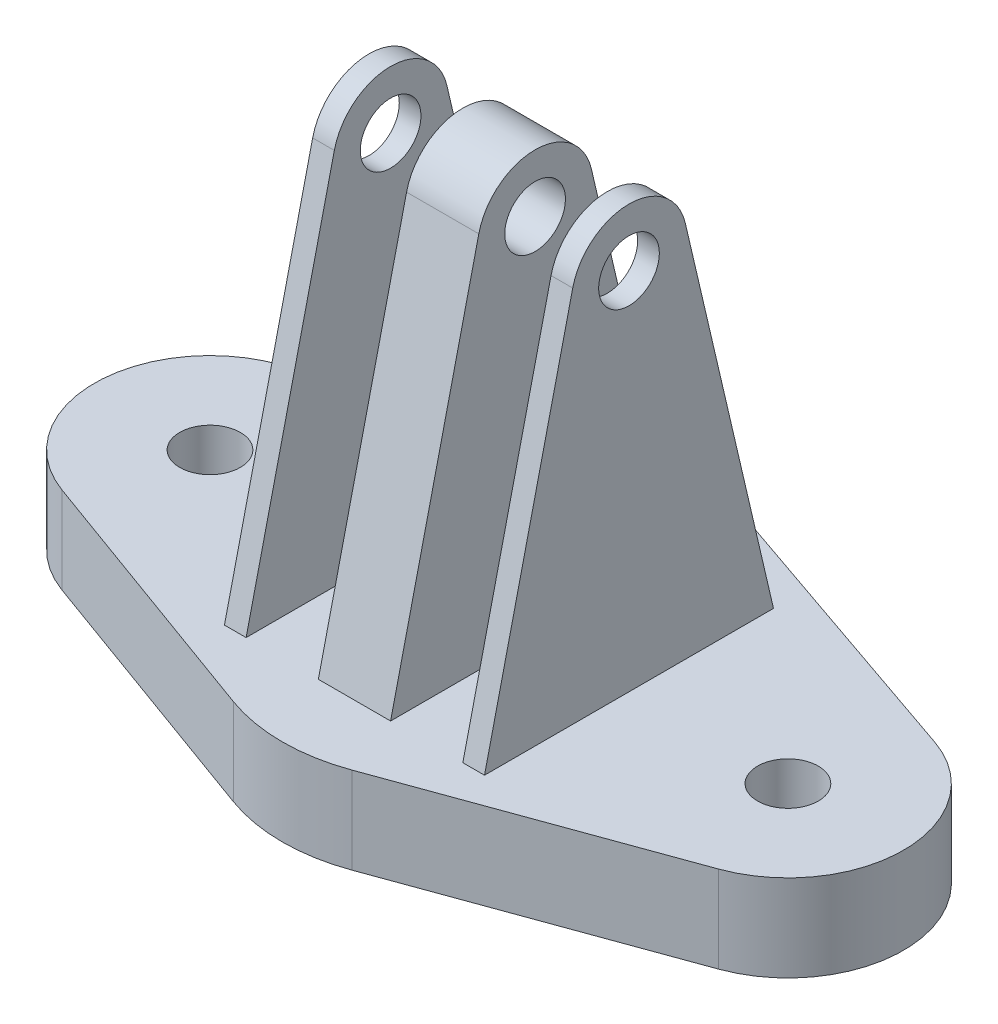
ISO-10303-21;
HEADER;
FILE_DESCRIPTION(('STEP AP214'),'2;1');
FILE_NAME('part.step','',(''),(''),'','','');
FILE_SCHEMA(('AUTOMOTIVE_DESIGN { 1 0 10303 214 1 1 1 1 }'));
ENDSEC;
DATA;
#1=APPLICATION_CONTEXT('core data for automotive mechanical design processes');
#2=APPLICATION_PROTOCOL_DEFINITION('international standard','automotive_design',2000,#1);
#3=PRODUCT_CONTEXT('',#1,'mechanical');
#4=PRODUCT('Part','Part','',(#3));
#5=PRODUCT_RELATED_PRODUCT_CATEGORY('part','',(#4));
#6=PRODUCT_DEFINITION_FORMATION('','',#4);
#7=PRODUCT_DEFINITION_CONTEXT('part definition',#1,'design');
#8=PRODUCT_DEFINITION('design','',#6,#7);
#9=PRODUCT_DEFINITION_SHAPE('','',#8);
#10=(LENGTH_UNIT() NAMED_UNIT(*) SI_UNIT(.MILLI.,.METRE.));
#11=(NAMED_UNIT(*) PLANE_ANGLE_UNIT() SI_UNIT($,.RADIAN.));
#12=(NAMED_UNIT(*) SI_UNIT($,.STERADIAN.) SOLID_ANGLE_UNIT());
#13=UNCERTAINTY_MEASURE_WITH_UNIT(LENGTH_MEASURE(1.E-05),#10,'distance_accuracy_value','');
#14=(GEOMETRIC_REPRESENTATION_CONTEXT(3) GLOBAL_UNCERTAINTY_ASSIGNED_CONTEXT((#13)) GLOBAL_UNIT_ASSIGNED_CONTEXT((#10,
#11,#12)) REPRESENTATION_CONTEXT('',''));
#15=CARTESIAN_POINT('',(0.,0.,0.));
#16=DIRECTION('',(0.,0.,1.));
#17=DIRECTION('',(1.,0.,0.));
#18=AXIS2_PLACEMENT_3D('',#15,#16,#17);
#19=CARTESIAN_POINT('',(9.,32.1493734715345,-3.8952586421532));
#20=DIRECTION('',(0.,-0.227343367883637,0.9738146605383));
#21=DIRECTION('',(0.,-0.9738146605383,-0.227343367883637));
#22=AXIS2_PLACEMENT_3D('',#19,#20,#21);
#23=PLANE('',#22);
#24=DIRECTION('',(0.,0.9738146605383,0.227343367883637));
#25=VECTOR('',#24,1.);
#26=CARTESIAN_POINT('',(2.5,32.1493734715345,-3.8952586421532));
#27=LINE('',#26,#25);
#28=CARTESIAN_POINT('',(2.5,6.,-10.));
#29=VERTEX_POINT('',#28);
#30=CARTESIAN_POINT('',(2.5,32.1493734715345,-3.8952586421532));
#31=VERTEX_POINT('',#30);
#32=EDGE_CURVE('E323',#29,#31,#27,.T.);
#33=ORIENTED_EDGE('',*,*,#32,.F.);
#34=DIRECTION('',(-1.,0.,0.));
#35=VECTOR('',#34,1.);
#36=CARTESIAN_POINT('',(9.,6.,-10.));
#37=LINE('',#36,#35);
#38=CARTESIAN_POINT('',(-2.5,6.,-10.));
#39=VERTEX_POINT('',#38);
#40=EDGE_CURVE('E212',#29,#39,#37,.T.);
#41=ORIENTED_EDGE('',*,*,#40,.T.);
#42=DIRECTION('',(0.,0.9738146605383,0.227343367883637));
#43=VECTOR('',#42,1.);
#44=CARTESIAN_POINT('',(-2.5,32.1493734715345,-3.8952586421532));
#45=LINE('',#44,#43);
#46=CARTESIAN_POINT('',(-2.5,32.1493734715345,-3.8952586421532));
#47=VERTEX_POINT('',#46);
#48=EDGE_CURVE('E295',#39,#47,#45,.T.);
#49=ORIENTED_EDGE('',*,*,#48,.T.);
#50=DIRECTION('',(-1.,0.,0.));
#51=VECTOR('',#50,1.);
#52=CARTESIAN_POINT('',(9.,32.1493734715345,-3.8952586421532));
#53=LINE('',#52,#51);
#54=EDGE_CURVE('E230',#31,#47,#53,.T.);
#55=ORIENTED_EDGE('',*,*,#54,.F.);
#56=EDGE_LOOP('',(#33,#41,#49,#55));
#57=FACE_BOUND('',#56,.T.);
#58=ADVANCED_FACE('F43',(#57),#23,.F.);
#59=DIRECTION('',(0.,-0.9738146605383,-0.227343367883637));
#60=VECTOR('',#59,1.);
#61=CARTESIAN_POINT('',(7.5,32.1493734715345,-3.8952586421532));
#62=LINE('',#61,#60);
#63=CARTESIAN_POINT('',(7.5,32.1493734715345,-3.8952586421532));
#64=VERTEX_POINT('',#63);
#65=CARTESIAN_POINT('',(7.5,6.,-10.));
#66=VERTEX_POINT('',#65);
#67=EDGE_CURVE('E182',#64,#66,#62,.T.);
#68=ORIENTED_EDGE('',*,*,#67,.F.);
#69=CARTESIAN_POINT('',(9.,32.1493734715345,-3.8952586421532));
#70=VERTEX_POINT('',#69);
#71=EDGE_CURVE('E223',#70,#64,#53,.T.);
#72=ORIENTED_EDGE('',*,*,#71,.F.);
#73=DIRECTION('',(0.,0.9738146605383,0.227343367883637));
#74=VECTOR('',#73,1.);
#75=CARTESIAN_POINT('',(9.,32.1493734715345,-3.8952586421532));
#76=LINE('',#75,#74);
#77=CARTESIAN_POINT('',(9.,6.,-10.));
#78=VERTEX_POINT('',#77);
#79=EDGE_CURVE('E208',#78,#70,#76,.T.);
#80=ORIENTED_EDGE('',*,*,#79,.F.);
#81=EDGE_CURVE('E200',#78,#66,#37,.T.);
#82=ORIENTED_EDGE('',*,*,#81,.T.);
#83=EDGE_LOOP('',(#68,#72,#80,#82));
#84=FACE_BOUND('',#83,.T.);
#85=ADVANCED_FACE('F207',(#84),#23,.F.);
#86=CARTESIAN_POINT('',(9.,31.24,0.));
#87=DIRECTION('',(-1.,0.,0.));
#88=DIRECTION('',(0.,0.,1.));
#89=AXIS2_PLACEMENT_3D('',#86,#87,#88);
#90=CYLINDRICAL_SURFACE('',#89,4.);
#91=CARTESIAN_POINT('',(2.5,31.24,0.));
#92=DIRECTION('',(1.,0.,0.));
#93=DIRECTION('',(0.,1.,0.));
#94=AXIS2_PLACEMENT_3D('',#91,#92,#93);
#95=CIRCLE('',#94,4.);
#96=CARTESIAN_POINT('',(2.5,32.1493734715345,3.8952586421532));
#97=VERTEX_POINT('',#96);
#98=EDGE_CURVE('E329',#31,#97,#95,.T.);
#99=ORIENTED_EDGE('',*,*,#98,.F.);
#100=ORIENTED_EDGE('',*,*,#54,.T.);
#101=CARTESIAN_POINT('',(-2.5,31.24,0.));
#102=DIRECTION('',(1.,0.,0.));
#103=DIRECTION('',(0.,1.,0.));
#104=AXIS2_PLACEMENT_3D('',#101,#102,#103);
#105=CIRCLE('',#104,4.);
#106=CARTESIAN_POINT('',(-2.5,32.1493734715345,3.8952586421532));
#107=VERTEX_POINT('',#106);
#108=EDGE_CURVE('E302',#47,#107,#105,.T.);
#109=ORIENTED_EDGE('',*,*,#108,.T.);
#110=DIRECTION('',(-1.,0.,0.));
#111=VECTOR('',#110,1.);
#112=CARTESIAN_POINT('',(9.,32.1493734715345,3.8952586421532));
#113=LINE('',#112,#111);
#114=EDGE_CURVE('E243',#97,#107,#113,.T.);
#115=ORIENTED_EDGE('',*,*,#114,.F.);
#116=EDGE_LOOP('',(#99,#100,#109,#115));
#117=FACE_BOUND('',#116,.T.);
#118=ADVANCED_FACE('F377',(#117),#90,.T.);
#119=CARTESIAN_POINT('',(7.5,31.24,0.));
#120=DIRECTION('',(-1.,0.,0.));
#121=DIRECTION('',(0.,-1.,0.));
#122=AXIS2_PLACEMENT_3D('',#119,#120,#121);
#123=CIRCLE('',#122,4.);
#124=CARTESIAN_POINT('',(7.5,32.1493734715345,3.8952586421532));
#125=VERTEX_POINT('',#124);
#126=EDGE_CURVE('E188',#125,#64,#123,.T.);
#127=ORIENTED_EDGE('',*,*,#126,.F.);
#128=CARTESIAN_POINT('',(9.,32.1493734715345,3.8952586421532));
#129=VERTEX_POINT('',#128);
#130=EDGE_CURVE('E237',#129,#125,#113,.T.);
#131=ORIENTED_EDGE('',*,*,#130,.F.);
#132=CARTESIAN_POINT('',(9.,31.24,0.));
#133=DIRECTION('',(1.,0.,0.));
#134=DIRECTION('',(0.,0.,1.));
#135=AXIS2_PLACEMENT_3D('',#132,#133,#134);
#136=CIRCLE('',#135,4.);
#137=EDGE_CURVE('E266',#70,#129,#136,.T.);
#138=ORIENTED_EDGE('',*,*,#137,.F.);
#139=ORIENTED_EDGE('',*,*,#71,.T.);
#140=EDGE_LOOP('',(#127,#131,#138,#139));
#141=FACE_BOUND('',#140,.T.);
#142=ADVANCED_FACE('F386',(#141),#90,.T.);
#143=CARTESIAN_POINT('',(9.,6.,10.));
#144=DIRECTION('',(0.,-0.227343367883637,-0.9738146605383));
#145=DIRECTION('',(0.,0.9738146605383,-0.227343367883637));
#146=AXIS2_PLACEMENT_3D('',#143,#144,#145);
#147=PLANE('',#146);
#148=DIRECTION('',(0.,-0.9738146605383,0.227343367883637));
#149=VECTOR('',#148,1.);
#150=CARTESIAN_POINT('',(2.5,6.,10.));
#151=LINE('',#150,#149);
#152=CARTESIAN_POINT('',(2.5,6.,10.));
#153=VERTEX_POINT('',#152);
#154=EDGE_CURVE('E332',#97,#153,#151,.T.);
#155=ORIENTED_EDGE('',*,*,#154,.F.);
#156=ORIENTED_EDGE('',*,*,#114,.T.);
#157=DIRECTION('',(0.,-0.9738146605383,0.227343367883637));
#158=VECTOR('',#157,1.);
#159=CARTESIAN_POINT('',(-2.5,6.,10.));
#160=LINE('',#159,#158);
#161=CARTESIAN_POINT('',(-2.5,6.,10.));
#162=VERTEX_POINT('',#161);
#163=EDGE_CURVE('E306',#107,#162,#160,.T.);
#164=ORIENTED_EDGE('',*,*,#163,.T.);
#165=DIRECTION('',(-1.,0.,0.));
#166=VECTOR('',#165,1.);
#167=CARTESIAN_POINT('',(9.,6.,10.));
#168=LINE('',#167,#166);
#169=EDGE_CURVE('E255',#153,#162,#168,.T.);
#170=ORIENTED_EDGE('',*,*,#169,.F.);
#171=EDGE_LOOP('',(#155,#156,#164,#170));
#172=FACE_BOUND('',#171,.T.);
#173=ADVANCED_FACE('F384',(#172),#147,.F.);
#174=DIRECTION('',(0.,0.9738146605383,-0.227343367883637));
#175=VECTOR('',#174,1.);
#176=CARTESIAN_POINT('',(7.5,6.,10.));
#177=LINE('',#176,#175);
#178=CARTESIAN_POINT('',(7.5,6.,10.));
#179=VERTEX_POINT('',#178);
#180=EDGE_CURVE('E340',#179,#125,#177,.T.);
#181=ORIENTED_EDGE('',*,*,#180,.F.);
#182=CARTESIAN_POINT('',(9.,6.,10.));
#183=VERTEX_POINT('',#182);
#184=EDGE_CURVE('E203',#183,#179,#168,.T.);
#185=ORIENTED_EDGE('',*,*,#184,.F.);
#186=DIRECTION('',(0.,-0.9738146605383,0.227343367883637));
#187=VECTOR('',#186,1.);
#188=CARTESIAN_POINT('',(9.,6.,10.));
#189=LINE('',#188,#187);
#190=EDGE_CURVE('E260',#129,#183,#189,.T.);
#191=ORIENTED_EDGE('',*,*,#190,.F.);
#192=ORIENTED_EDGE('',*,*,#130,.T.);
#193=EDGE_LOOP('',(#181,#185,#191,#192));
#194=FACE_BOUND('',#193,.T.);
#195=ADVANCED_FACE('F360',(#194),#147,.F.);
#196=CARTESIAN_POINT('',(9.,31.24,0.));
#197=DIRECTION('',(-1.,0.,0.));
#198=DIRECTION('',(0.,0.,1.));
#199=AXIS2_PLACEMENT_3D('',#196,#197,#198);
#200=CYLINDRICAL_SURFACE('',#199,2.1);
#201=CARTESIAN_POINT('',(-2.5,31.24,0.));
#202=DIRECTION('',(1.,0.,0.));
#203=DIRECTION('',(0.,1.,0.));
#204=AXIS2_PLACEMENT_3D('',#201,#202,#203);
#205=CIRCLE('',#204,2.1);
#206=CARTESIAN_POINT('',(-2.5,33.34,0.));
#207=VERTEX_POINT('',#206);
#208=EDGE_CURVE('E47',#207,#207,#205,.T.);
#209=ORIENTED_EDGE('',*,*,#208,.F.);
#210=EDGE_LOOP('',(#209));
#211=FACE_BOUND('',#210,.T.);
#212=CARTESIAN_POINT('',(2.5,31.24,0.));
#213=DIRECTION('',(1.,0.,0.));
#214=DIRECTION('',(0.,1.,0.));
#215=AXIS2_PLACEMENT_3D('',#212,#213,#214);
#216=CIRCLE('',#215,2.1);
#217=CARTESIAN_POINT('',(2.5,33.34,0.));
#218=VERTEX_POINT('',#217);
#219=EDGE_CURVE('E194',#218,#218,#216,.T.);
#220=ORIENTED_EDGE('',*,*,#219,.T.);
#221=EDGE_LOOP('',(#220));
#222=FACE_BOUND('',#221,.T.);
#223=ADVANCED_FACE('F356',(#211,#222),#200,.F.);
#224=CARTESIAN_POINT('',(9.,31.24,0.));
#225=DIRECTION('',(1.,0.,0.));
#226=DIRECTION('',(0.,0.,-1.));
#227=AXIS2_PLACEMENT_3D('',#224,#225,#226);
#228=CIRCLE('',#227,2.1);
#229=CARTESIAN_POINT('',(9.,31.24,-2.1));
#230=VERTEX_POINT('',#229);
#231=EDGE_CURVE('E277',#230,#230,#228,.T.);
#232=ORIENTED_EDGE('',*,*,#231,.T.);
#233=EDGE_LOOP('',(#232));
#234=FACE_BOUND('',#233,.T.);
#235=CARTESIAN_POINT('',(7.5,31.24,0.));
#236=DIRECTION('',(-1.,0.,0.));
#237=DIRECTION('',(0.,-1.,0.));
#238=AXIS2_PLACEMENT_3D('',#235,#236,#237);
#239=CIRCLE('',#238,2.1);
#240=CARTESIAN_POINT('',(7.5,29.14,0.));
#241=VERTEX_POINT('',#240);
#242=EDGE_CURVE('E205',#241,#241,#239,.T.);
#243=ORIENTED_EDGE('',*,*,#242,.T.);
#244=EDGE_LOOP('',(#243));
#245=FACE_BOUND('',#244,.T.);
#246=ADVANCED_FACE('F359',(#234,#245),#200,.F.);
#247=CARTESIAN_POINT('',(20.,6.,0.));
#248=DIRECTION('',(0.,-1.,0.));
#249=DIRECTION('',(0.,0.,-1.));
#250=AXIS2_PLACEMENT_3D('',#247,#248,#249);
#251=PLANE('',#250);
#252=ORIENTED_EDGE('',*,*,#40,.F.);
#253=DIRECTION('',(0.,0.,1.));
#254=VECTOR('',#253,1.);
#255=CARTESIAN_POINT('',(2.5,6.,-15.));
#256=LINE('',#255,#254);
#257=EDGE_CURVE('E61',#29,#153,#256,.T.);
#258=ORIENTED_EDGE('',*,*,#257,.T.);
#259=ORIENTED_EDGE('',*,*,#169,.T.);
#260=DIRECTION('',(0.,0.,1.));
#261=VECTOR('',#260,1.);
#262=CARTESIAN_POINT('',(-2.5,6.,-15.));
#263=LINE('',#262,#261);
#264=EDGE_CURVE('E322',#39,#162,#263,.T.);
#265=ORIENTED_EDGE('',*,*,#264,.F.);
#266=EDGE_LOOP('',(#252,#258,#259,#265));
#267=FACE_BOUND('',#266,.T.);
#268=DIRECTION('',(0.,0.,1.));
#269=VECTOR('',#268,1.);
#270=CARTESIAN_POINT('',(7.5,6.,-15.));
#271=LINE('',#270,#269);
#272=EDGE_CURVE('E185',#66,#179,#271,.T.);
#273=ORIENTED_EDGE('',*,*,#272,.F.);
#274=ORIENTED_EDGE('',*,*,#81,.F.);
#275=DIRECTION('',(0.,0.,-1.));
#276=VECTOR('',#275,1.);
#277=CARTESIAN_POINT('',(9.,6.,-10.));
#278=LINE('',#277,#276);
#279=EDGE_CURVE('E284',#183,#78,#278,.T.);
#280=ORIENTED_EDGE('',*,*,#279,.F.);
#281=ORIENTED_EDGE('',*,*,#184,.T.);
#282=EDGE_LOOP('',(#273,#274,#280,#281));
#283=FACE_BOUND('',#282,.T.);
#284=DIRECTION('',(-0.945543853132705,0.,-0.325494733909717));
#285=VECTOR('',#284,1.);
#286=CARTESIAN_POINT('',(22.6039578712777,6.,-7.56435082506164));
#287=LINE('',#286,#285);
#288=CARTESIAN_POINT('',(22.6039578712777,6.,-7.56435082506164));
#289=VERTEX_POINT('',#288);
#290=CARTESIAN_POINT('',(1.9529684034583,6.,-14.6732631187962));
#291=VERTEX_POINT('',#290);
#292=EDGE_CURVE('E817',#289,#291,#287,.T.);
#293=ORIENTED_EDGE('',*,*,#292,.T.);
#294=CARTESIAN_POINT('',(0.,6.,-9.));
#295=DIRECTION('',(0.,1.,0.));
#296=DIRECTION('',(0.,0.,1.));
#297=AXIS2_PLACEMENT_3D('',#294,#295,#296);
#298=CIRCLE('',#297,6.);
#299=CARTESIAN_POINT('',(-1.95296840345831,6.,-14.6732631187962));
#300=VERTEX_POINT('',#299);
#301=EDGE_CURVE('E776',#291,#300,#298,.T.);
#302=ORIENTED_EDGE('',*,*,#301,.T.);
#303=DIRECTION('',(0.945543853132705,0.,-0.325494733909717));
#304=VECTOR('',#303,1.);
#305=CARTESIAN_POINT('',(-22.6039578712777,6.,-7.56435082506164));
#306=LINE('',#305,#304);
#307=CARTESIAN_POINT('',(-22.6039578712777,6.,-7.56435082506164));
#308=VERTEX_POINT('',#307);
#309=EDGE_CURVE('E801',#308,#300,#306,.T.);
#310=ORIENTED_EDGE('',*,*,#309,.F.);
#311=CARTESIAN_POINT('',(-20.,6.,0.));
#312=DIRECTION('',(0.,-1.,0.));
#313=DIRECTION('',(0.,0.,-1.));
#314=AXIS2_PLACEMENT_3D('',#311,#312,#313);
#315=CIRCLE('',#314,8.);
#316=CARTESIAN_POINT('',(-22.7280720353017,6.,7.52048023534436));
#317=VERTEX_POINT('',#316);
#318=EDGE_CURVE('E786',#317,#308,#315,.T.);
#319=ORIENTED_EDGE('',*,*,#318,.F.);
#320=DIRECTION('',(-0.940060029418045,0.,-0.341009004412706));
#321=VECTOR('',#320,1.);
#322=CARTESIAN_POINT('',(-22.7280720353017,6.,7.52048023534436));
#323=LINE('',#322,#321);
#324=CARTESIAN_POINT('',(-4.09210805295248,6.,14.2807203530165));
#325=VERTEX_POINT('',#324);
#326=EDGE_CURVE('E792',#325,#317,#323,.T.);
#327=ORIENTED_EDGE('',*,*,#326,.F.);
#328=CARTESIAN_POINT('',(0.,6.,3.));
#329=DIRECTION('',(0.,1.,0.));
#330=DIRECTION('',(0.,0.,-1.));
#331=AXIS2_PLACEMENT_3D('',#328,#329,#330);
#332=CIRCLE('',#331,12.);
#333=CARTESIAN_POINT('',(4.09210805295248,6.,14.2807203530165));
#334=VERTEX_POINT('',#333);
#335=EDGE_CURVE('E821',#325,#334,#332,.T.);
#336=ORIENTED_EDGE('',*,*,#335,.T.);
#337=DIRECTION('',(0.940060029418045,0.,-0.341009004412707));
#338=VECTOR('',#337,1.);
#339=CARTESIAN_POINT('',(22.7280720353017,6.,7.52048023534436));
#340=LINE('',#339,#338);
#341=CARTESIAN_POINT('',(22.7280720353017,6.,7.52048023534436));
#342=VERTEX_POINT('',#341);
#343=EDGE_CURVE('E750',#334,#342,#340,.T.);
#344=ORIENTED_EDGE('',*,*,#343,.T.);
#345=CARTESIAN_POINT('',(20.,6.,0.));
#346=DIRECTION('',(0.,1.,0.));
#347=DIRECTION('',(0.,0.,-1.));
#348=AXIS2_PLACEMENT_3D('',#345,#346,#347);
#349=CIRCLE('',#348,8.);
#350=EDGE_CURVE('E761',#342,#289,#349,.T.);
#351=ORIENTED_EDGE('',*,*,#350,.T.);
#352=EDGE_LOOP('',(#293,#302,#310,#319,#327,#336,#344,#351));
#353=FACE_BOUND('',#352,.T.);
#354=CARTESIAN_POINT('',(20.,6.,0.));
#355=DIRECTION('',(0.,1.,0.));
#356=DIRECTION('',(0.,0.,1.));
#357=AXIS2_PLACEMENT_3D('',#354,#355,#356);
#358=CIRCLE('',#357,2.1);
#359=CARTESIAN_POINT('',(20.,6.,2.1));
#360=VERTEX_POINT('',#359);
#361=EDGE_CURVE('E740',#360,#360,#358,.T.);
#362=ORIENTED_EDGE('',*,*,#361,.F.);
#363=EDGE_LOOP('',(#362));
#364=FACE_BOUND('',#363,.T.);
#365=DIRECTION('',(0.,0.,1.));
#366=VECTOR('',#365,1.);
#367=CARTESIAN_POINT('',(-7.5,6.,-15.));
#368=LINE('',#367,#366);
#369=CARTESIAN_POINT('',(-7.5,6.,-10.));
#370=VERTEX_POINT('',#369);
#371=CARTESIAN_POINT('',(-7.5,6.,10.));
#372=VERTEX_POINT('',#371);
#373=EDGE_CURVE('E319',#370,#372,#368,.T.);
#374=ORIENTED_EDGE('',*,*,#373,.T.);
#375=CARTESIAN_POINT('',(-9.,6.,10.));
#376=VERTEX_POINT('',#375);
#377=EDGE_CURVE('E256',#372,#376,#168,.T.);
#378=ORIENTED_EDGE('',*,*,#377,.T.);
#379=DIRECTION('',(0.,0.,-1.));
#380=VECTOR('',#379,1.);
#381=CARTESIAN_POINT('',(-9.,6.,-10.));
#382=LINE('',#381,#380);
#383=CARTESIAN_POINT('',(-9.,6.,-10.));
#384=VERTEX_POINT('',#383);
#385=EDGE_CURVE('E273',#376,#384,#382,.T.);
#386=ORIENTED_EDGE('',*,*,#385,.T.);
#387=EDGE_CURVE('E214',#370,#384,#37,.T.);
#388=ORIENTED_EDGE('',*,*,#387,.F.);
#389=EDGE_LOOP('',(#374,#378,#386,#388));
#390=FACE_BOUND('',#389,.T.);
#391=CARTESIAN_POINT('',(-20.,6.,0.));
#392=DIRECTION('',(0.,-1.,0.));
#393=DIRECTION('',(0.,0.,1.));
#394=AXIS2_PLACEMENT_3D('',#391,#392,#393);
#395=CIRCLE('',#394,2.1);
#396=CARTESIAN_POINT('',(-20.,6.,2.1));
#397=VERTEX_POINT('',#396);
#398=EDGE_CURVE('E218',#397,#397,#395,.T.);
#399=ORIENTED_EDGE('',*,*,#398,.T.);
#400=EDGE_LOOP('',(#399));
#401=FACE_BOUND('',#400,.T.);
#402=ADVANCED_FACE('F198',(#267,#283,#353,#364,#390,#401),#251,.F.);
#403=CARTESIAN_POINT('',(20.,0.,0.));
#404=DIRECTION('',(0.,-1.,0.));
#405=DIRECTION('',(0.,0.,-1.));
#406=AXIS2_PLACEMENT_3D('',#403,#404,#405);
#407=PLANE('',#406);
#408=CARTESIAN_POINT('',(20.,0.,0.));
#409=DIRECTION('',(0.,1.,0.));
#410=DIRECTION('',(0.,0.,-1.));
#411=AXIS2_PLACEMENT_3D('',#408,#409,#410);
#412=CIRCLE('',#411,8.);
#413=CARTESIAN_POINT('',(22.7280720353017,0.,7.52048023534436));
#414=VERTEX_POINT('',#413);
#415=CARTESIAN_POINT('',(22.6039578712777,0.,-7.56435082506164));
#416=VERTEX_POINT('',#415);
#417=EDGE_CURVE('E733',#414,#416,#412,.T.);
#418=ORIENTED_EDGE('',*,*,#417,.F.);
#419=DIRECTION('',(0.940060029418045,0.,-0.341009004412707));
#420=VECTOR('',#419,1.);
#421=CARTESIAN_POINT('',(22.7280720353017,0.,7.52048023534436));
#422=LINE('',#421,#420);
#423=CARTESIAN_POINT('',(4.09210805295248,0.,14.2807203530165));
#424=VERTEX_POINT('',#423);
#425=EDGE_CURVE('E758',#424,#414,#422,.T.);
#426=ORIENTED_EDGE('',*,*,#425,.F.);
#427=CARTESIAN_POINT('',(0.,0.,3.));
#428=DIRECTION('',(0.,1.,0.));
#429=DIRECTION('',(0.,0.,-1.));
#430=AXIS2_PLACEMENT_3D('',#427,#428,#429);
#431=CIRCLE('',#430,12.);
#432=CARTESIAN_POINT('',(-4.09210805295248,0.,14.2807203530165));
#433=VERTEX_POINT('',#432);
#434=EDGE_CURVE('E755',#433,#424,#431,.T.);
#435=ORIENTED_EDGE('',*,*,#434,.F.);
#436=DIRECTION('',(-0.940060029418045,0.,-0.341009004412706));
#437=VECTOR('',#436,1.);
#438=CARTESIAN_POINT('',(-22.7280720353017,0.,7.52048023534436));
#439=LINE('',#438,#437);
#440=CARTESIAN_POINT('',(-22.7280720353017,0.,7.52048023534436));
#441=VERTEX_POINT('',#440);
#442=EDGE_CURVE('E787',#433,#441,#439,.T.);
#443=ORIENTED_EDGE('',*,*,#442,.T.);
#444=CARTESIAN_POINT('',(-20.,0.,0.));
#445=DIRECTION('',(0.,-1.,0.));
#446=DIRECTION('',(0.,0.,-1.));
#447=AXIS2_PLACEMENT_3D('',#444,#445,#446);
#448=CIRCLE('',#447,8.);
#449=CARTESIAN_POINT('',(-22.6039578712777,0.,-7.56435082506164));
#450=VERTEX_POINT('',#449);
#451=EDGE_CURVE('E784',#441,#450,#448,.T.);
#452=ORIENTED_EDGE('',*,*,#451,.T.);
#453=DIRECTION('',(0.945543853132705,0.,-0.325494733909717));
#454=VECTOR('',#453,1.);
#455=CARTESIAN_POINT('',(-22.6039578712777,0.,-7.56435082506164));
#456=LINE('',#455,#454);
#457=CARTESIAN_POINT('',(-1.95296840345831,0.,-14.6732631187962));
#458=VERTEX_POINT('',#457);
#459=EDGE_CURVE('E781',#450,#458,#456,.T.);
#460=ORIENTED_EDGE('',*,*,#459,.T.);
#461=CARTESIAN_POINT('',(0.,0.,-9.));
#462=DIRECTION('',(0.,1.,0.));
#463=DIRECTION('',(0.,0.,1.));
#464=AXIS2_PLACEMENT_3D('',#461,#462,#463);
#465=CIRCLE('',#464,6.);
#466=CARTESIAN_POINT('',(1.9529684034583,0.,-14.6732631187962));
#467=VERTEX_POINT('',#466);
#468=EDGE_CURVE('E744',#467,#458,#465,.T.);
#469=ORIENTED_EDGE('',*,*,#468,.F.);
#470=DIRECTION('',(-0.945543853132705,0.,-0.325494733909717));
#471=VECTOR('',#470,1.);
#472=CARTESIAN_POINT('',(22.6039578712777,0.,-7.56435082506164));
#473=LINE('',#472,#471);
#474=EDGE_CURVE('E739',#416,#467,#473,.T.);
#475=ORIENTED_EDGE('',*,*,#474,.F.);
#476=EDGE_LOOP('',(#418,#426,#435,#443,#452,#460,#469,#475));
#477=FACE_BOUND('',#476,.T.);
#478=CARTESIAN_POINT('',(20.,0.,0.));
#479=DIRECTION('',(0.,1.,0.));
#480=DIRECTION('',(0.,0.,1.));
#481=AXIS2_PLACEMENT_3D('',#478,#479,#480);
#482=CIRCLE('',#481,2.1);
#483=CARTESIAN_POINT('',(20.,0.,2.1));
#484=VERTEX_POINT('',#483);
#485=EDGE_CURVE('E747',#484,#484,#482,.T.);
#486=ORIENTED_EDGE('',*,*,#485,.T.);
#487=EDGE_LOOP('',(#486));
#488=FACE_BOUND('',#487,.T.);
#489=CARTESIAN_POINT('',(-20.,0.,0.));
#490=DIRECTION('',(0.,-1.,0.));
#491=DIRECTION('',(0.,0.,1.));
#492=AXIS2_PLACEMENT_3D('',#489,#490,#491);
#493=CIRCLE('',#492,2.1);
#494=CARTESIAN_POINT('',(-20.,0.,2.1));
#495=VERTEX_POINT('',#494);
#496=EDGE_CURVE('E211',#495,#495,#493,.T.);
#497=ORIENTED_EDGE('',*,*,#496,.F.);
#498=EDGE_LOOP('',(#497));
#499=FACE_BOUND('',#498,.T.);
#500=ADVANCED_FACE('F500',(#477,#488,#499),#407,.T.);
#501=CARTESIAN_POINT('',(20.,6.,0.));
#502=DIRECTION('',(0.,-1.,0.));
#503=DIRECTION('',(0.,0.,-1.));
#504=AXIS2_PLACEMENT_3D('',#501,#502,#503);
#505=CYLINDRICAL_SURFACE('',#504,8.);
#506=ORIENTED_EDGE('',*,*,#417,.T.);
#507=DIRECTION('',(0.,-1.,0.));
#508=VECTOR('',#507,1.);
#509=CARTESIAN_POINT('',(22.6039578712777,6.,-7.56435082506164));
#510=LINE('',#509,#508);
#511=EDGE_CURVE('E11',#289,#416,#510,.T.);
#512=ORIENTED_EDGE('',*,*,#511,.F.);
#513=ORIENTED_EDGE('',*,*,#350,.F.);
#514=DIRECTION('',(0.,-1.,0.));
#515=VECTOR('',#514,1.);
#516=CARTESIAN_POINT('',(22.7280720353017,6.,7.52048023534436));
#517=LINE('',#516,#515);
#518=EDGE_CURVE('E736',#342,#414,#517,.T.);
#519=ORIENTED_EDGE('',*,*,#518,.T.);
#520=EDGE_LOOP('',(#506,#512,#513,#519));
#521=FACE_BOUND('',#520,.T.);
#522=ADVANCED_FACE('F45',(#521),#505,.T.);
#523=CARTESIAN_POINT('',(22.6039578712777,6.,-7.56435082506164));
#524=DIRECTION('',(-0.325494733909717,0.,0.945543853132705));
#525=DIRECTION('',(0.945543853132705,0.,0.325494733909717));
#526=AXIS2_PLACEMENT_3D('',#523,#524,#525);
#527=PLANE('',#526);
#528=ORIENTED_EDGE('',*,*,#474,.T.);
#529=DIRECTION('',(0.,-1.,0.));
#530=VECTOR('',#529,1.);
#531=CARTESIAN_POINT('',(1.9529684034583,6.,-14.6732631187962));
#532=LINE('',#531,#530);
#533=EDGE_CURVE('E53',#291,#467,#532,.T.);
#534=ORIENTED_EDGE('',*,*,#533,.F.);
#535=ORIENTED_EDGE('',*,*,#292,.F.);
#536=ORIENTED_EDGE('',*,*,#511,.T.);
#537=EDGE_LOOP('',(#528,#534,#535,#536));
#538=FACE_BOUND('',#537,.T.);
#539=ADVANCED_FACE('F484',(#538),#527,.F.);
#540=CARTESIAN_POINT('',(0.,6.,-9.));
#541=DIRECTION('',(0.,-1.,0.));
#542=DIRECTION('',(0.,0.,-1.));
#543=AXIS2_PLACEMENT_3D('',#540,#541,#542);
#544=CYLINDRICAL_SURFACE('',#543,6.);
#545=ORIENTED_EDGE('',*,*,#468,.T.);
#546=DIRECTION('',(0.,-1.,0.));
#547=VECTOR('',#546,1.);
#548=CARTESIAN_POINT('',(-1.95296840345831,6.,-14.6732631187962));
#549=LINE('',#548,#547);
#550=EDGE_CURVE('E800',#300,#458,#549,.T.);
#551=ORIENTED_EDGE('',*,*,#550,.F.);
#552=ORIENTED_EDGE('',*,*,#301,.F.);
#553=ORIENTED_EDGE('',*,*,#533,.T.);
#554=EDGE_LOOP('',(#545,#551,#552,#553));
#555=FACE_BOUND('',#554,.T.);
#556=ADVANCED_FACE('F475',(#555),#544,.T.);
#557=CARTESIAN_POINT('',(0.,6.,3.));
#558=DIRECTION('',(0.,-1.,0.));
#559=DIRECTION('',(0.,0.,-1.));
#560=AXIS2_PLACEMENT_3D('',#557,#558,#559);
#561=CYLINDRICAL_SURFACE('',#560,12.);
#562=ORIENTED_EDGE('',*,*,#434,.T.);
#563=DIRECTION('',(0.,-1.,0.));
#564=VECTOR('',#563,1.);
#565=CARTESIAN_POINT('',(4.09210805295248,6.,14.2807203530165));
#566=LINE('',#565,#564);
#567=EDGE_CURVE('E764',#334,#424,#566,.T.);
#568=ORIENTED_EDGE('',*,*,#567,.F.);
#569=ORIENTED_EDGE('',*,*,#335,.F.);
#570=DIRECTION('',(0.,-1.,0.));
#571=VECTOR('',#570,1.);
#572=CARTESIAN_POINT('',(-4.09210805295248,6.,14.2807203530165));
#573=LINE('',#572,#571);
#574=EDGE_CURVE('E804',#325,#433,#573,.T.);
#575=ORIENTED_EDGE('',*,*,#574,.T.);
#576=EDGE_LOOP('',(#562,#568,#569,#575));
#577=FACE_BOUND('',#576,.T.);
#578=ADVANCED_FACE('F461',(#577),#561,.T.);
#579=CARTESIAN_POINT('',(22.7280720353017,6.,7.52048023534436));
#580=DIRECTION('',(-0.341009004412706,0.,-0.940060029418044));
#581=DIRECTION('',(-0.940060029418045,0.,0.341009004412707));
#582=AXIS2_PLACEMENT_3D('',#579,#580,#581);
#583=PLANE('',#582);
#584=ORIENTED_EDGE('',*,*,#425,.T.);
#585=ORIENTED_EDGE('',*,*,#518,.F.);
#586=ORIENTED_EDGE('',*,*,#343,.F.);
#587=ORIENTED_EDGE('',*,*,#567,.T.);
#588=EDGE_LOOP('',(#584,#585,#586,#587));
#589=FACE_BOUND('',#588,.T.);
#590=ADVANCED_FACE('F455',(#589),#583,.F.);
#591=CARTESIAN_POINT('',(20.,6.,0.));
#592=DIRECTION('',(0.,-1.,0.));
#593=DIRECTION('',(0.,0.,-1.));
#594=AXIS2_PLACEMENT_3D('',#591,#592,#593);
#595=CYLINDRICAL_SURFACE('',#594,2.1);
#596=ORIENTED_EDGE('',*,*,#361,.T.);
#597=EDGE_LOOP('',(#596));
#598=FACE_BOUND('',#597,.T.);
#599=ORIENTED_EDGE('',*,*,#485,.F.);
#600=EDGE_LOOP('',(#599));
#601=FACE_BOUND('',#600,.T.);
#602=ADVANCED_FACE('F460',(#598,#601),#595,.F.);
#603=CARTESIAN_POINT('',(-20.,6.,0.));
#604=DIRECTION('',(0.,-1.,0.));
#605=DIRECTION('',(0.,0.,-1.));
#606=AXIS2_PLACEMENT_3D('',#603,#604,#605);
#607=CYLINDRICAL_SURFACE('',#606,8.);
#608=ORIENTED_EDGE('',*,*,#451,.F.);
#609=DIRECTION('',(0.,-1.,0.));
#610=VECTOR('',#609,1.);
#611=CARTESIAN_POINT('',(-22.7280720353017,6.,7.52048023534436));
#612=LINE('',#611,#610);
#613=EDGE_CURVE('E808',#317,#441,#612,.T.);
#614=ORIENTED_EDGE('',*,*,#613,.F.);
#615=ORIENTED_EDGE('',*,*,#318,.T.);
#616=DIRECTION('',(0.,-1.,0.));
#617=VECTOR('',#616,1.);
#618=CARTESIAN_POINT('',(-22.6039578712777,6.,-7.56435082506164));
#619=LINE('',#618,#617);
#620=EDGE_CURVE('E797',#308,#450,#619,.T.);
#621=ORIENTED_EDGE('',*,*,#620,.T.);
#622=EDGE_LOOP('',(#608,#614,#615,#621));
#623=FACE_BOUND('',#622,.T.);
#624=ADVANCED_FACE('F615',(#623),#607,.T.);
#625=CARTESIAN_POINT('',(-22.7280720353017,6.,7.52048023534436));
#626=DIRECTION('',(-0.341009004412706,0.,0.940060029418044));
#627=DIRECTION('',(0.940060029418045,0.,0.341009004412706));
#628=AXIS2_PLACEMENT_3D('',#625,#626,#627);
#629=PLANE('',#628);
#630=ORIENTED_EDGE('',*,*,#442,.F.);
#631=ORIENTED_EDGE('',*,*,#574,.F.);
#632=ORIENTED_EDGE('',*,*,#326,.T.);
#633=ORIENTED_EDGE('',*,*,#613,.T.);
#634=EDGE_LOOP('',(#630,#631,#632,#633));
#635=FACE_BOUND('',#634,.T.);
#636=ADVANCED_FACE('F603',(#635),#629,.T.);
#637=CARTESIAN_POINT('',(-22.6039578712777,6.,-7.56435082506164));
#638=DIRECTION('',(-0.325494733909717,0.,-0.945543853132705));
#639=DIRECTION('',(-0.945543853132705,0.,0.325494733909717));
#640=AXIS2_PLACEMENT_3D('',#637,#638,#639);
#641=PLANE('',#640);
#642=ORIENTED_EDGE('',*,*,#459,.F.);
#643=ORIENTED_EDGE('',*,*,#620,.F.);
#644=ORIENTED_EDGE('',*,*,#309,.T.);
#645=ORIENTED_EDGE('',*,*,#550,.T.);
#646=EDGE_LOOP('',(#642,#643,#644,#645));
#647=FACE_BOUND('',#646,.T.);
#648=ADVANCED_FACE('F432',(#647),#641,.T.);
#649=CARTESIAN_POINT('',(-20.,6.,0.));
#650=DIRECTION('',(0.,-1.,0.));
#651=DIRECTION('',(0.,0.,-1.));
#652=AXIS2_PLACEMENT_3D('',#649,#650,#651);
#653=CYLINDRICAL_SURFACE('',#652,2.1);
#654=ORIENTED_EDGE('',*,*,#398,.F.);
#655=EDGE_LOOP('',(#654));
#656=FACE_BOUND('',#655,.T.);
#657=ORIENTED_EDGE('',*,*,#496,.T.);
#658=EDGE_LOOP('',(#657));
#659=FACE_BOUND('',#658,.T.);
#660=ADVANCED_FACE('F428',(#656,#659),#653,.F.);
#661=CARTESIAN_POINT('',(9.,31.24,0.));
#662=DIRECTION('',(-1.,0.,0.));
#663=DIRECTION('',(0.,0.,1.));
#664=AXIS2_PLACEMENT_3D('',#661,#662,#663);
#665=PLANE('',#664);
#666=ORIENTED_EDGE('',*,*,#279,.T.);
#667=ORIENTED_EDGE('',*,*,#79,.T.);
#668=ORIENTED_EDGE('',*,*,#137,.T.);
#669=ORIENTED_EDGE('',*,*,#190,.T.);
#670=EDGE_LOOP('',(#666,#667,#668,#669));
#671=FACE_BOUND('',#670,.T.);
#672=ORIENTED_EDGE('',*,*,#231,.F.);
#673=EDGE_LOOP('',(#672));
#674=FACE_BOUND('',#673,.T.);
#675=ADVANCED_FACE('F410',(#671,#674),#665,.F.);
#676=CARTESIAN_POINT('',(-9.,31.24,0.));
#677=DIRECTION('',(-1.,0.,0.));
#678=DIRECTION('',(0.,0.,1.));
#679=AXIS2_PLACEMENT_3D('',#676,#677,#678);
#680=PLANE('',#679);
#681=ORIENTED_EDGE('',*,*,#385,.F.);
#682=DIRECTION('',(0.,-0.9738146605383,0.227343367883637));
#683=VECTOR('',#682,1.);
#684=CARTESIAN_POINT('',(-9.,6.,10.));
#685=LINE('',#684,#683);
#686=CARTESIAN_POINT('',(-9.,32.1493734715345,3.8952586421532));
#687=VERTEX_POINT('',#686);
#688=EDGE_CURVE('E282',#687,#376,#685,.T.);
#689=ORIENTED_EDGE('',*,*,#688,.F.);
#690=CARTESIAN_POINT('',(-9.,31.24,0.));
#691=DIRECTION('',(1.,0.,0.));
#692=DIRECTION('',(0.,0.,1.));
#693=AXIS2_PLACEMENT_3D('',#690,#691,#692);
#694=CIRCLE('',#693,4.);
#695=CARTESIAN_POINT('',(-9.,32.1493734715345,-3.8952586421532));
#696=VERTEX_POINT('',#695);
#697=EDGE_CURVE('E280',#696,#687,#694,.T.);
#698=ORIENTED_EDGE('',*,*,#697,.F.);
#699=DIRECTION('',(0.,0.9738146605383,0.227343367883637));
#700=VECTOR('',#699,1.);
#701=CARTESIAN_POINT('',(-9.,32.1493734715345,-3.8952586421532));
#702=LINE('',#701,#700);
#703=EDGE_CURVE('E276',#384,#696,#702,.T.);
#704=ORIENTED_EDGE('',*,*,#703,.F.);
#705=EDGE_LOOP('',(#681,#689,#698,#704));
#706=FACE_BOUND('',#705,.T.);
#707=CARTESIAN_POINT('',(-9.,31.24,0.));
#708=DIRECTION('',(1.,0.,0.));
#709=DIRECTION('',(0.,0.,-1.));
#710=AXIS2_PLACEMENT_3D('',#707,#708,#709);
#711=CIRCLE('',#710,2.1);
#712=CARTESIAN_POINT('',(-9.,31.24,-2.1));
#713=VERTEX_POINT('',#712);
#714=EDGE_CURVE('E291',#713,#713,#711,.T.);
#715=ORIENTED_EDGE('',*,*,#714,.T.);
#716=EDGE_LOOP('',(#715));
#717=FACE_BOUND('',#716,.T.);
#718=ADVANCED_FACE('F405',(#706,#717),#680,.T.);
#719=CARTESIAN_POINT('',(-7.5,32.1493734715345,-3.8952586421532));
#720=VERTEX_POINT('',#719);
#721=EDGE_CURVE('E231',#720,#696,#53,.T.);
#722=ORIENTED_EDGE('',*,*,#721,.F.);
#723=DIRECTION('',(0.,-0.9738146605383,-0.227343367883637));
#724=VECTOR('',#723,1.);
#725=CARTESIAN_POINT('',(-7.5,32.1493734715345,-3.8952586421532));
#726=LINE('',#725,#724);
#727=EDGE_CURVE('E310',#720,#370,#726,.T.);
#728=ORIENTED_EDGE('',*,*,#727,.T.);
#729=ORIENTED_EDGE('',*,*,#387,.T.);
#730=ORIENTED_EDGE('',*,*,#703,.T.);
#731=EDGE_LOOP('',(#722,#728,#729,#730));
#732=FACE_BOUND('',#731,.T.);
#733=ADVANCED_FACE('F399',(#732),#23,.F.);
#734=CARTESIAN_POINT('',(-7.5,32.1493734715345,3.8952586421532));
#735=VERTEX_POINT('',#734);
#736=EDGE_CURVE('E244',#735,#687,#113,.T.);
#737=ORIENTED_EDGE('',*,*,#736,.F.);
#738=CARTESIAN_POINT('',(-7.5,31.24,0.));
#739=DIRECTION('',(-1.,0.,0.));
#740=DIRECTION('',(0.,-1.,0.));
#741=AXIS2_PLACEMENT_3D('',#738,#739,#740);
#742=CIRCLE('',#741,4.);
#743=EDGE_CURVE('E69',#735,#720,#742,.T.);
#744=ORIENTED_EDGE('',*,*,#743,.T.);
#745=ORIENTED_EDGE('',*,*,#721,.T.);
#746=ORIENTED_EDGE('',*,*,#697,.T.);
#747=EDGE_LOOP('',(#737,#744,#745,#746));
#748=FACE_BOUND('',#747,.T.);
#749=ADVANCED_FACE('F394',(#748),#90,.T.);
#750=ORIENTED_EDGE('',*,*,#377,.F.);
#751=DIRECTION('',(0.,0.9738146605383,-0.227343367883637));
#752=VECTOR('',#751,1.);
#753=CARTESIAN_POINT('',(-7.5,6.,10.));
#754=LINE('',#753,#752);
#755=EDGE_CURVE('E315',#372,#735,#754,.T.);
#756=ORIENTED_EDGE('',*,*,#755,.T.);
#757=ORIENTED_EDGE('',*,*,#736,.T.);
#758=ORIENTED_EDGE('',*,*,#688,.T.);
#759=EDGE_LOOP('',(#750,#756,#757,#758));
#760=FACE_BOUND('',#759,.T.);
#761=ADVANCED_FACE('F388',(#760),#147,.F.);
#762=CARTESIAN_POINT('',(-7.5,31.24,0.));
#763=DIRECTION('',(-1.,0.,0.));
#764=DIRECTION('',(0.,-1.,0.));
#765=AXIS2_PLACEMENT_3D('',#762,#763,#764);
#766=CIRCLE('',#765,2.1);
#767=CARTESIAN_POINT('',(-7.5,29.14,0.));
#768=VERTEX_POINT('',#767);
#769=EDGE_CURVE('E318',#768,#768,#766,.T.);
#770=ORIENTED_EDGE('',*,*,#769,.F.);
#771=EDGE_LOOP('',(#770));
#772=FACE_BOUND('',#771,.T.);
#773=ORIENTED_EDGE('',*,*,#714,.F.);
#774=EDGE_LOOP('',(#773));
#775=FACE_BOUND('',#774,.T.);
#776=ADVANCED_FACE('F362',(#772,#775),#200,.F.);
#777=CARTESIAN_POINT('',(-2.5,64.48,-15.));
#778=DIRECTION('',(1.,0.,0.));
#779=DIRECTION('',(0.,1.,0.));
#780=AXIS2_PLACEMENT_3D('',#777,#778,#779);
#781=PLANE('',#780);
#782=ORIENTED_EDGE('',*,*,#208,.T.);
#783=EDGE_LOOP('',(#782));
#784=FACE_BOUND('',#783,.T.);
#785=ORIENTED_EDGE('',*,*,#264,.T.);
#786=ORIENTED_EDGE('',*,*,#163,.F.);
#787=ORIENTED_EDGE('',*,*,#108,.F.);
#788=ORIENTED_EDGE('',*,*,#48,.F.);
#789=EDGE_LOOP('',(#785,#786,#787,#788));
#790=FACE_BOUND('',#789,.T.);
#791=ADVANCED_FACE('F353',(#784,#790),#781,.F.);
#792=CARTESIAN_POINT('',(-7.5,64.48,-15.));
#793=DIRECTION('',(-1.,0.,0.));
#794=DIRECTION('',(0.,-1.,0.));
#795=AXIS2_PLACEMENT_3D('',#792,#793,#794);
#796=PLANE('',#795);
#797=ORIENTED_EDGE('',*,*,#769,.T.);
#798=EDGE_LOOP('',(#797));
#799=FACE_BOUND('',#798,.T.);
#800=ORIENTED_EDGE('',*,*,#743,.F.);
#801=ORIENTED_EDGE('',*,*,#755,.F.);
#802=ORIENTED_EDGE('',*,*,#373,.F.);
#803=ORIENTED_EDGE('',*,*,#727,.F.);
#804=EDGE_LOOP('',(#800,#801,#802,#803));
#805=FACE_BOUND('',#804,.T.);
#806=ADVANCED_FACE('F368',(#799,#805),#796,.F.);
#807=CARTESIAN_POINT('',(2.5,64.48,-15.));
#808=DIRECTION('',(1.,0.,0.));
#809=DIRECTION('',(0.,1.,0.));
#810=AXIS2_PLACEMENT_3D('',#807,#808,#809);
#811=PLANE('',#810);
#812=ORIENTED_EDGE('',*,*,#219,.F.);
#813=EDGE_LOOP('',(#812));
#814=FACE_BOUND('',#813,.T.);
#815=ORIENTED_EDGE('',*,*,#32,.T.);
#816=ORIENTED_EDGE('',*,*,#98,.T.);
#817=ORIENTED_EDGE('',*,*,#154,.T.);
#818=ORIENTED_EDGE('',*,*,#257,.F.);
#819=EDGE_LOOP('',(#815,#816,#817,#818));
#820=FACE_BOUND('',#819,.T.);
#821=ADVANCED_FACE('F365',(#814,#820),#811,.T.);
#822=CARTESIAN_POINT('',(7.5,64.48,-15.));
#823=DIRECTION('',(-1.,0.,0.));
#824=DIRECTION('',(0.,-1.,0.));
#825=AXIS2_PLACEMENT_3D('',#822,#823,#824);
#826=PLANE('',#825);
#827=ORIENTED_EDGE('',*,*,#242,.F.);
#828=EDGE_LOOP('',(#827));
#829=FACE_BOUND('',#828,.T.);
#830=ORIENTED_EDGE('',*,*,#67,.T.);
#831=ORIENTED_EDGE('',*,*,#272,.T.);
#832=ORIENTED_EDGE('',*,*,#180,.T.);
#833=ORIENTED_EDGE('',*,*,#126,.T.);
#834=EDGE_LOOP('',(#830,#831,#832,#833));
#835=FACE_BOUND('',#834,.T.);
#836=ADVANCED_FACE('F184',(#829,#835),#826,.T.);
#837=CLOSED_SHELL('',(#58,#85,#118,#142,#173,#195,#223,#246,#402,#500,#522,#539,#556,#578,#590,
#602,#624,#636,#648,#660,#675,#718,#733,#749,#761,#776,#791,#806,#821,#836));
#838=MANIFOLD_SOLID_BREP('B2',#837);
#839=ADVANCED_BREP_SHAPE_REPRESENTATION('',(#18,#838),#14);
#840=SHAPE_DEFINITION_REPRESENTATION(#9,#839);
ENDSEC;
END-ISO-10303-21;
